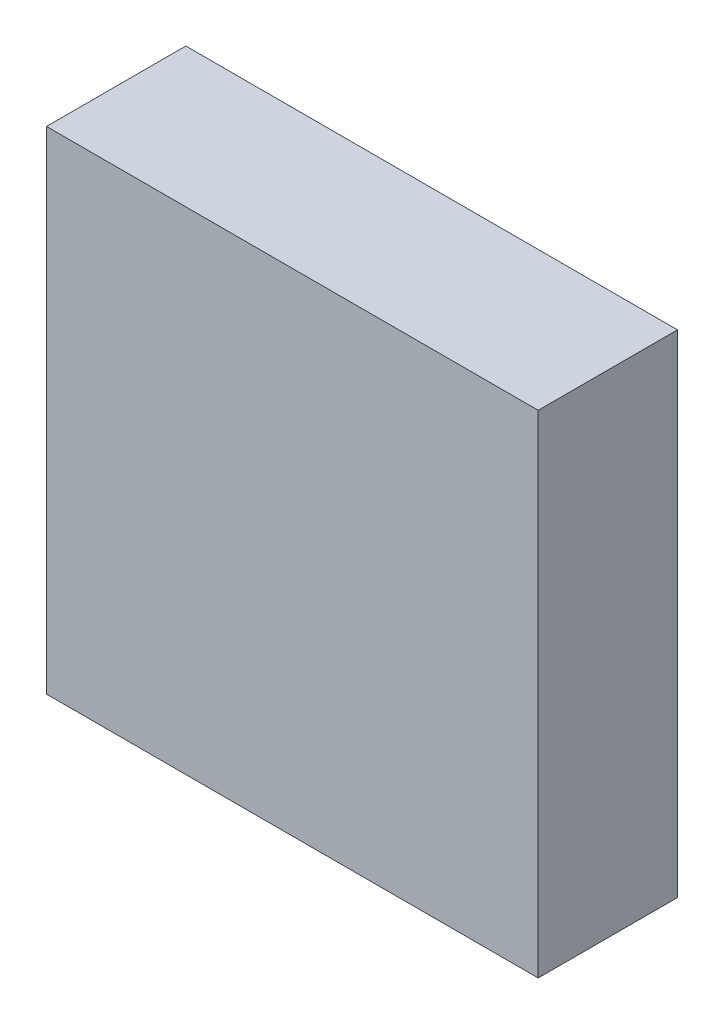
ISO-10303-21;
HEADER;
FILE_DESCRIPTION(('STEP AP214'),'2;1');
FILE_NAME('part.step','',(''),(''),'','','');
FILE_SCHEMA(('AUTOMOTIVE_DESIGN { 1 0 10303 214 1 1 1 1 }'));
ENDSEC;
DATA;
#1=APPLICATION_CONTEXT('core data for automotive mechanical design processes');
#2=APPLICATION_PROTOCOL_DEFINITION('international standard','automotive_design',2000,#1);
#3=PRODUCT_CONTEXT('',#1,'mechanical');
#4=PRODUCT('Part','Part','',(#3));
#5=PRODUCT_RELATED_PRODUCT_CATEGORY('part','',(#4));
#6=PRODUCT_DEFINITION_FORMATION('','',#4);
#7=PRODUCT_DEFINITION_CONTEXT('part definition',#1,'design');
#8=PRODUCT_DEFINITION('design','',#6,#7);
#9=PRODUCT_DEFINITION_SHAPE('','',#8);
#10=(LENGTH_UNIT() NAMED_UNIT(*) SI_UNIT(.MILLI.,.METRE.));
#11=(NAMED_UNIT(*) PLANE_ANGLE_UNIT() SI_UNIT($,.RADIAN.));
#12=(NAMED_UNIT(*) SI_UNIT($,.STERADIAN.) SOLID_ANGLE_UNIT());
#13=UNCERTAINTY_MEASURE_WITH_UNIT(LENGTH_MEASURE(1.E-05),#10,'distance_accuracy_value','');
#14=(GEOMETRIC_REPRESENTATION_CONTEXT(3) GLOBAL_UNCERTAINTY_ASSIGNED_CONTEXT((#13)) GLOBAL_UNIT_ASSIGNED_CONTEXT((#10,
#11,#12)) REPRESENTATION_CONTEXT('',''));
#15=CARTESIAN_POINT('',(0.,0.,0.));
#16=DIRECTION('',(0.,0.,1.));
#17=DIRECTION('',(1.,0.,0.));
#18=AXIS2_PLACEMENT_3D('',#15,#16,#17);
#19=CARTESIAN_POINT('',(1.50000208,-1.50000208,0.));
#20=DIRECTION('',(8.46665493990997E-07,-0.999999999999642,0.));
#21=DIRECTION('',(-0.999999999999642,-8.46665493990997E-07,0.));
#22=AXIS2_PLACEMENT_3D('',#19,#20,#21);
#23=PLANE('',#22);
#24=DIRECTION('',(0.,0.,1.));
#25=VECTOR('',#24,1.);
#26=CARTESIAN_POINT('',(1.50000208,-1.50000208,0.));
#27=LINE('',#26,#25);
#28=CARTESIAN_POINT('',(1.50000208,-1.50000208,0.));
#29=VERTEX_POINT('',#28);
#30=CARTESIAN_POINT('',(1.50000208,-1.50000208,0.85000084));
#31=VERTEX_POINT('',#30);
#32=EDGE_CURVE('E11',#29,#31,#27,.T.);
#33=ORIENTED_EDGE('',*,*,#32,.T.);
#34=DIRECTION('',(-0.999999999999642,-8.46665493990997E-07,0.));
#35=VECTOR('',#34,1.);
#36=CARTESIAN_POINT('',(1.50000208,-1.50000208,0.85000084));
#37=LINE('',#36,#35);
#38=CARTESIAN_POINT('',(-1.50000208,-1.50000462,0.85000084));
#39=VERTEX_POINT('',#38);
#40=EDGE_CURVE('E24',#31,#39,#37,.T.);
#41=ORIENTED_EDGE('',*,*,#40,.T.);
#42=DIRECTION('',(0.,0.,1.));
#43=VECTOR('',#42,1.);
#44=CARTESIAN_POINT('',(-1.50000208,-1.50000462,0.));
#45=LINE('',#44,#43);
#46=CARTESIAN_POINT('',(-1.50000208,-1.50000462,0.));
#47=VERTEX_POINT('',#46);
#48=EDGE_CURVE('E85',#47,#39,#45,.T.);
#49=ORIENTED_EDGE('',*,*,#48,.F.);
#50=DIRECTION('',(-0.999999999999642,-8.46665493990997E-07,0.));
#51=VECTOR('',#50,1.);
#52=CARTESIAN_POINT('',(1.50000208,-1.50000208,0.));
#53=LINE('',#52,#51);
#54=EDGE_CURVE('E83',#29,#47,#53,.T.);
#55=ORIENTED_EDGE('',*,*,#54,.F.);
#56=EDGE_LOOP('',(#33,#41,#49,#55));
#57=FACE_BOUND('',#56,.T.);
#58=ADVANCED_FACE('F17',(#57),#23,.T.);
#59=CARTESIAN_POINT('',(-1.50000208,-1.50000462,0.));
#60=DIRECTION('',(-0.999999999999642,-8.46666925309797E-07,0.));
#61=DIRECTION('',(-8.46666925309797E-07,0.999999999999642,0.));
#62=AXIS2_PLACEMENT_3D('',#59,#60,#61);
#63=PLANE('',#62);
#64=ORIENTED_EDGE('',*,*,#48,.T.);
#65=DIRECTION('',(-8.46666925309797E-07,0.999999999999642,0.));
#66=VECTOR('',#65,1.);
#67=CARTESIAN_POINT('',(-1.50000208,-1.50000462,0.85000084));
#68=LINE('',#67,#66);
#69=CARTESIAN_POINT('',(-1.50000462,1.49999446,0.85000084));
#70=VERTEX_POINT('',#69);
#71=EDGE_CURVE('E81',#39,#70,#68,.T.);
#72=ORIENTED_EDGE('',*,*,#71,.T.);
#73=DIRECTION('',(0.,0.,1.));
#74=VECTOR('',#73,1.);
#75=CARTESIAN_POINT('',(-1.50000462,1.49999446,0.));
#76=LINE('',#75,#74);
#77=CARTESIAN_POINT('',(-1.50000462,1.49999446,0.));
#78=VERTEX_POINT('',#77);
#79=EDGE_CURVE('E79',#78,#70,#76,.T.);
#80=ORIENTED_EDGE('',*,*,#79,.F.);
#81=DIRECTION('',(-8.46666925309797E-07,0.999999999999642,0.));
#82=VECTOR('',#81,1.);
#83=CARTESIAN_POINT('',(-1.50000208,-1.50000462,0.));
#84=LINE('',#83,#82);
#85=EDGE_CURVE('E70',#47,#78,#84,.T.);
#86=ORIENTED_EDGE('',*,*,#85,.F.);
#87=EDGE_LOOP('',(#64,#72,#80,#86));
#88=FACE_BOUND('',#87,.T.);
#89=ADVANCED_FACE('F90',(#88),#63,.T.);
#90=CARTESIAN_POINT('',(-1.50000462,1.49999446,0.));
#91=DIRECTION('',(-3.3866562388489E-06,0.999999999994265,0.));
#92=DIRECTION('',(0.999999999994265,3.3866562388489E-06,0.));
#93=AXIS2_PLACEMENT_3D('',#90,#91,#92);
#94=PLANE('',#93);
#95=ORIENTED_EDGE('',*,*,#79,.T.);
#96=DIRECTION('',(0.999999999994265,3.3866562388489E-06,0.));
#97=VECTOR('',#96,1.);
#98=CARTESIAN_POINT('',(-1.50000462,1.49999446,0.85000084));
#99=LINE('',#98,#97);
#100=CARTESIAN_POINT('',(1.50000462,1.50000462,0.85000084));
#101=VERTEX_POINT('',#100);
#102=EDGE_CURVE('E60',#70,#101,#99,.T.);
#103=ORIENTED_EDGE('',*,*,#102,.T.);
#104=DIRECTION('',(0.,0.,1.));
#105=VECTOR('',#104,1.);
#106=CARTESIAN_POINT('',(1.50000462,1.50000462,0.));
#107=LINE('',#106,#105);
#108=CARTESIAN_POINT('',(1.50000462,1.50000462,0.));
#109=VERTEX_POINT('',#108);
#110=EDGE_CURVE('E54',#109,#101,#107,.T.);
#111=ORIENTED_EDGE('',*,*,#110,.F.);
#112=DIRECTION('',(0.999999999994265,3.3866562388489E-06,0.));
#113=VECTOR('',#112,1.);
#114=CARTESIAN_POINT('',(-1.50000462,1.49999446,0.));
#115=LINE('',#114,#113);
#116=EDGE_CURVE('E58',#78,#109,#115,.T.);
#117=ORIENTED_EDGE('',*,*,#116,.F.);
#118=EDGE_LOOP('',(#95,#103,#111,#117));
#119=FACE_BOUND('',#118,.T.);
#120=ADVANCED_FACE('F57',(#119),#94,.T.);
#121=CARTESIAN_POINT('',(1.50000462,1.50000462,0.));
#122=DIRECTION('',(0.999999999999642,-8.46664779517597E-07,0.));
#123=DIRECTION('',(-8.46664779517597E-07,-0.999999999999642,0.));
#124=AXIS2_PLACEMENT_3D('',#121,#122,#123);
#125=PLANE('',#124);
#126=ORIENTED_EDGE('',*,*,#110,.T.);
#127=DIRECTION('',(-8.46664779517597E-07,-0.999999999999642,0.));
#128=VECTOR('',#127,1.);
#129=CARTESIAN_POINT('',(1.50000462,1.50000462,0.85000084));
#130=LINE('',#129,#128);
#131=EDGE_CURVE('E71',#101,#31,#130,.T.);
#132=ORIENTED_EDGE('',*,*,#131,.T.);
#133=ORIENTED_EDGE('',*,*,#32,.F.);
#134=DIRECTION('',(-8.46664779517597E-07,-0.999999999999642,0.));
#135=VECTOR('',#134,1.);
#136=CARTESIAN_POINT('',(1.50000462,1.50000462,0.));
#137=LINE('',#136,#135);
#138=EDGE_CURVE('E68',#109,#29,#137,.T.);
#139=ORIENTED_EDGE('',*,*,#138,.F.);
#140=EDGE_LOOP('',(#126,#132,#133,#139));
#141=FACE_BOUND('',#140,.T.);
#142=ADVANCED_FACE('F73',(#141),#125,.T.);
#143=CARTESIAN_POINT('',(9.52500601907E-07,-1.269996364125E-06,0.));
#144=DIRECTION('',(0.,0.,-1.));
#145=DIRECTION('',(-1.,0.,0.));
#146=AXIS2_PLACEMENT_3D('',#143,#144,#145);
#147=PLANE('',#146);
#148=ORIENTED_EDGE('',*,*,#54,.T.);
#149=ORIENTED_EDGE('',*,*,#85,.T.);
#150=ORIENTED_EDGE('',*,*,#116,.T.);
#151=ORIENTED_EDGE('',*,*,#138,.T.);
#152=EDGE_LOOP('',(#148,#149,#150,#151));
#153=FACE_BOUND('',#152,.T.);
#154=ADVANCED_FACE('F67',(#153),#147,.T.);
#155=CARTESIAN_POINT('',(9.52500601907E-07,-1.269996364125E-06,0.85000084));
#156=DIRECTION('',(0.,0.,-1.));
#157=DIRECTION('',(-1.,0.,0.));
#158=AXIS2_PLACEMENT_3D('',#155,#156,#157);
#159=PLANE('',#158);
#160=ORIENTED_EDGE('',*,*,#131,.F.);
#161=ORIENTED_EDGE('',*,*,#102,.F.);
#162=ORIENTED_EDGE('',*,*,#71,.F.);
#163=ORIENTED_EDGE('',*,*,#40,.F.);
#164=EDGE_LOOP('',(#160,#161,#162,#163));
#165=FACE_BOUND('',#164,.T.);
#166=ADVANCED_FACE('F91',(#165),#159,.F.);
#167=CLOSED_SHELL('',(#58,#89,#120,#142,#154,#166));
#168=MANIFOLD_SOLID_BREP('B1',#167);
#169=ADVANCED_BREP_SHAPE_REPRESENTATION('',(#18,#168),#14);
#170=SHAPE_DEFINITION_REPRESENTATION(#9,#169);
ENDSEC;
END-ISO-10303-21;
